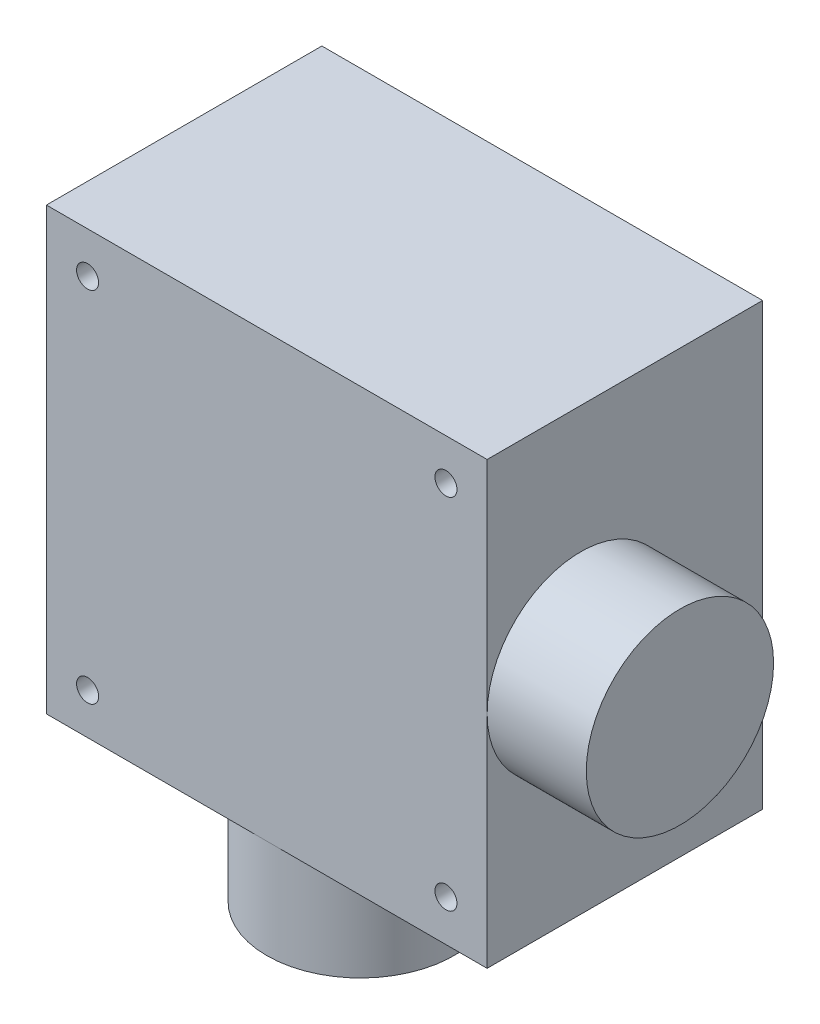
ISO-10303-21;
HEADER;
FILE_DESCRIPTION(('STEP AP214'),'2;1');
FILE_NAME('part.step','',(''),(''),'','','');
FILE_SCHEMA(('AUTOMOTIVE_DESIGN { 1 0 10303 214 1 1 1 1 }'));
ENDSEC;
DATA;
#1=APPLICATION_CONTEXT('core data for automotive mechanical design processes');
#2=APPLICATION_PROTOCOL_DEFINITION('international standard','automotive_design',2000,#1);
#3=PRODUCT_CONTEXT('',#1,'mechanical');
#4=PRODUCT('Part','Part','',(#3));
#5=PRODUCT_RELATED_PRODUCT_CATEGORY('part','',(#4));
#6=PRODUCT_DEFINITION_FORMATION('','',#4);
#7=PRODUCT_DEFINITION_CONTEXT('part definition',#1,'design');
#8=PRODUCT_DEFINITION('design','',#6,#7);
#9=PRODUCT_DEFINITION_SHAPE('','',#8);
#10=(LENGTH_UNIT() NAMED_UNIT(*) SI_UNIT(.MILLI.,.METRE.));
#11=(NAMED_UNIT(*) PLANE_ANGLE_UNIT() SI_UNIT($,.RADIAN.));
#12=(NAMED_UNIT(*) SI_UNIT($,.STERADIAN.) SOLID_ANGLE_UNIT());
#13=UNCERTAINTY_MEASURE_WITH_UNIT(LENGTH_MEASURE(1.E-05),#10,'distance_accuracy_value','');
#14=(GEOMETRIC_REPRESENTATION_CONTEXT(3) GLOBAL_UNCERTAINTY_ASSIGNED_CONTEXT((#13)) GLOBAL_UNIT_ASSIGNED_CONTEXT((#10,
#11,#12)) REPRESENTATION_CONTEXT('',''));
#15=CARTESIAN_POINT('',(0.,0.,0.));
#16=DIRECTION('',(0.,0.,1.));
#17=DIRECTION('',(1.,0.,0.));
#18=AXIS2_PLACEMENT_3D('',#15,#16,#17);
#19=CARTESIAN_POINT('',(-20.,20.,25.));
#20=DIRECTION('',(1.,0.,0.));
#21=DIRECTION('',(0.,1.,0.));
#22=AXIS2_PLACEMENT_3D('',#19,#20,#21);
#23=PLANE('',#22);
#24=DIRECTION('',(0.,-1.,0.));
#25=VECTOR('',#24,1.);
#26=CARTESIAN_POINT('',(-20.,20.,0.));
#27=LINE('',#26,#25);
#28=CARTESIAN_POINT('',(-20.,20.,0.));
#29=VERTEX_POINT('',#28);
#30=CARTESIAN_POINT('',(-20.,-20.,0.));
#31=VERTEX_POINT('',#30);
#32=EDGE_CURVE('E107',#29,#31,#27,.T.);
#33=ORIENTED_EDGE('',*,*,#32,.T.);
#34=DIRECTION('',(0.,0.,-1.));
#35=VECTOR('',#34,1.);
#36=CARTESIAN_POINT('',(-20.,-20.,25.));
#37=LINE('',#36,#35);
#38=CARTESIAN_POINT('',(-20.,-20.,25.));
#39=VERTEX_POINT('',#38);
#40=EDGE_CURVE('E11',#39,#31,#37,.T.);
#41=ORIENTED_EDGE('',*,*,#40,.F.);
#42=DIRECTION('',(0.,-1.,0.));
#43=VECTOR('',#42,1.);
#44=CARTESIAN_POINT('',(-20.,20.,25.));
#45=LINE('',#44,#43);
#46=CARTESIAN_POINT('',(-20.,20.,25.));
#47=VERTEX_POINT('',#46);
#48=EDGE_CURVE('E91',#47,#39,#45,.T.);
#49=ORIENTED_EDGE('',*,*,#48,.F.);
#50=DIRECTION('',(0.,0.,-1.));
#51=VECTOR('',#50,1.);
#52=CARTESIAN_POINT('',(-20.,20.,25.));
#53=LINE('',#52,#51);
#54=EDGE_CURVE('E106',#47,#29,#53,.T.);
#55=ORIENTED_EDGE('',*,*,#54,.T.);
#56=EDGE_LOOP('',(#33,#41,#49,#55));
#57=FACE_BOUND('',#56,.T.);
#58=ADVANCED_FACE('F34',(#57),#23,.F.);
#59=CARTESIAN_POINT('',(-20.,-20.,25.));
#60=DIRECTION('',(0.,1.,0.));
#61=DIRECTION('',(0.,0.,1.));
#62=AXIS2_PLACEMENT_3D('',#59,#60,#61);
#63=PLANE('',#62);
#64=DIRECTION('',(1.,0.,0.));
#65=VECTOR('',#64,1.);
#66=CARTESIAN_POINT('',(-20.,-20.,25.));
#67=LINE('',#66,#65);
#68=CARTESIAN_POINT('',(0.,-20.,25.));
#69=VERTEX_POINT('',#68);
#70=CARTESIAN_POINT('',(20.,-20.,25.));
#71=VERTEX_POINT('',#70);
#72=EDGE_CURVE('E88',#69,#71,#67,.T.);
#73=ORIENTED_EDGE('',*,*,#72,.F.);
#74=CARTESIAN_POINT('',(0.,-20.,16.5));
#75=DIRECTION('',(0.,-1.,0.));
#76=DIRECTION('',(0.,0.,-1.));
#77=AXIS2_PLACEMENT_3D('',#74,#75,#76);
#78=CIRCLE('',#77,8.5);
#79=EDGE_CURVE('E97',#69,#69,#78,.T.);
#80=ORIENTED_EDGE('',*,*,#79,.F.);
#81=EDGE_CURVE('E82',#39,#69,#67,.T.);
#82=ORIENTED_EDGE('',*,*,#81,.F.);
#83=ORIENTED_EDGE('',*,*,#40,.T.);
#84=DIRECTION('',(1.,0.,0.));
#85=VECTOR('',#84,1.);
#86=CARTESIAN_POINT('',(-20.,-20.,0.));
#87=LINE('',#86,#85);
#88=CARTESIAN_POINT('',(20.,-20.,0.));
#89=VERTEX_POINT('',#88);
#90=EDGE_CURVE('E110',#31,#89,#87,.T.);
#91=ORIENTED_EDGE('',*,*,#90,.T.);
#92=DIRECTION('',(0.,0.,-1.));
#93=VECTOR('',#92,1.);
#94=CARTESIAN_POINT('',(20.,-20.,25.));
#95=LINE('',#94,#93);
#96=EDGE_CURVE('E41',#71,#89,#95,.T.);
#97=ORIENTED_EDGE('',*,*,#96,.F.);
#98=EDGE_LOOP('',(#73,#80,#82,#83,#91,#97));
#99=FACE_BOUND('',#98,.T.);
#100=ADVANCED_FACE('F95',(#99),#63,.F.);
#101=CARTESIAN_POINT('',(20.,20.,25.));
#102=DIRECTION('',(-1.,0.,0.));
#103=DIRECTION('',(0.,-1.,0.));
#104=AXIS2_PLACEMENT_3D('',#101,#102,#103);
#105=PLANE('',#104);
#106=DIRECTION('',(0.,1.,0.));
#107=VECTOR('',#106,1.);
#108=CARTESIAN_POINT('',(20.,20.,25.));
#109=LINE('',#108,#107);
#110=CARTESIAN_POINT('',(20.,0.,25.));
#111=VERTEX_POINT('',#110);
#112=CARTESIAN_POINT('',(20.,20.,25.));
#113=VERTEX_POINT('',#112);
#114=EDGE_CURVE('E93',#111,#113,#109,.T.);
#115=ORIENTED_EDGE('',*,*,#114,.F.);
#116=CARTESIAN_POINT('',(20.,0.,16.5));
#117=DIRECTION('',(-1.,0.,0.));
#118=DIRECTION('',(0.,0.,-1.));
#119=AXIS2_PLACEMENT_3D('',#116,#117,#118);
#120=CIRCLE('',#119,8.5);
#121=EDGE_CURVE('E46',#111,#111,#120,.T.);
#122=ORIENTED_EDGE('',*,*,#121,.T.);
#123=EDGE_CURVE('E103',#71,#111,#109,.T.);
#124=ORIENTED_EDGE('',*,*,#123,.F.);
#125=ORIENTED_EDGE('',*,*,#96,.T.);
#126=DIRECTION('',(0.,1.,0.));
#127=VECTOR('',#126,1.);
#128=CARTESIAN_POINT('',(20.,20.,0.));
#129=LINE('',#128,#127);
#130=CARTESIAN_POINT('',(20.,20.,0.));
#131=VERTEX_POINT('',#130);
#132=EDGE_CURVE('E113',#89,#131,#129,.T.);
#133=ORIENTED_EDGE('',*,*,#132,.T.);
#134=DIRECTION('',(0.,0.,-1.));
#135=VECTOR('',#134,1.);
#136=CARTESIAN_POINT('',(20.,20.,25.));
#137=LINE('',#136,#135);
#138=EDGE_CURVE('E117',#113,#131,#137,.T.);
#139=ORIENTED_EDGE('',*,*,#138,.F.);
#140=EDGE_LOOP('',(#115,#122,#124,#125,#133,#139));
#141=FACE_BOUND('',#140,.T.);
#142=ADVANCED_FACE('F121',(#141),#105,.F.);
#143=CARTESIAN_POINT('',(-20.,20.,25.));
#144=DIRECTION('',(0.,-1.,0.));
#145=DIRECTION('',(0.,0.,-1.));
#146=AXIS2_PLACEMENT_3D('',#143,#144,#145);
#147=PLANE('',#146);
#148=DIRECTION('',(-1.,0.,0.));
#149=VECTOR('',#148,1.);
#150=CARTESIAN_POINT('',(-20.,20.,0.));
#151=LINE('',#150,#149);
#152=EDGE_CURVE('E75',#131,#29,#151,.T.);
#153=ORIENTED_EDGE('',*,*,#152,.T.);
#154=ORIENTED_EDGE('',*,*,#54,.F.);
#155=DIRECTION('',(-1.,0.,0.));
#156=VECTOR('',#155,1.);
#157=CARTESIAN_POINT('',(-20.,20.,25.));
#158=LINE('',#157,#156);
#159=EDGE_CURVE('E54',#113,#47,#158,.T.);
#160=ORIENTED_EDGE('',*,*,#159,.F.);
#161=ORIENTED_EDGE('',*,*,#138,.T.);
#162=EDGE_LOOP('',(#153,#154,#160,#161));
#163=FACE_BOUND('',#162,.T.);
#164=ADVANCED_FACE('F127',(#163),#147,.F.);
#165=CARTESIAN_POINT('',(0.,0.,25.));
#166=DIRECTION('',(0.,0.,1.));
#167=DIRECTION('',(1.,0.,0.));
#168=AXIS2_PLACEMENT_3D('',#165,#166,#167);
#169=PLANE('',#168);
#170=CARTESIAN_POINT('',(16.2634559672906,16.2634559672906,25.));
#171=DIRECTION('',(0.,0.,1.));
#172=DIRECTION('',(1.,0.,0.));
#173=AXIS2_PLACEMENT_3D('',#170,#171,#172);
#174=CIRCLE('',#173,1.);
#175=CARTESIAN_POINT('',(17.2634559672906,16.2634559672906,25.));
#176=VERTEX_POINT('',#175);
#177=EDGE_CURVE('E172',#176,#176,#174,.T.);
#178=ORIENTED_EDGE('',*,*,#177,.F.);
#179=EDGE_LOOP('',(#178));
#180=FACE_BOUND('',#179,.T.);
#181=CARTESIAN_POINT('',(-16.2634559672906,-16.2634559672906,25.));
#182=DIRECTION('',(0.,0.,1.));
#183=DIRECTION('',(1.,0.,0.));
#184=AXIS2_PLACEMENT_3D('',#181,#182,#183);
#185=CIRCLE('',#184,1.);
#186=CARTESIAN_POINT('',(-15.2634559672906,-16.2634559672906,25.));
#187=VERTEX_POINT('',#186);
#188=EDGE_CURVE('E176',#187,#187,#185,.T.);
#189=ORIENTED_EDGE('',*,*,#188,.F.);
#190=EDGE_LOOP('',(#189));
#191=FACE_BOUND('',#190,.T.);
#192=CARTESIAN_POINT('',(16.2634559672906,-16.2634559672906,25.));
#193=DIRECTION('',(0.,0.,1.));
#194=DIRECTION('',(1.,0.,0.));
#195=AXIS2_PLACEMENT_3D('',#192,#193,#194);
#196=CIRCLE('',#195,1.);
#197=CARTESIAN_POINT('',(17.2634559672906,-16.2634559672906,25.));
#198=VERTEX_POINT('',#197);
#199=EDGE_CURVE('E180',#198,#198,#196,.T.);
#200=ORIENTED_EDGE('',*,*,#199,.F.);
#201=EDGE_LOOP('',(#200));
#202=FACE_BOUND('',#201,.T.);
#203=CARTESIAN_POINT('',(-16.2634559672906,16.2634559672906,25.));
#204=DIRECTION('',(0.,0.,1.));
#205=DIRECTION('',(1.,0.,0.));
#206=AXIS2_PLACEMENT_3D('',#203,#204,#205);
#207=CIRCLE('',#206,1.);
#208=CARTESIAN_POINT('',(-15.2634559672906,16.2634559672906,25.));
#209=VERTEX_POINT('',#208);
#210=EDGE_CURVE('E134',#209,#209,#207,.T.);
#211=ORIENTED_EDGE('',*,*,#210,.F.);
#212=EDGE_LOOP('',(#211));
#213=FACE_BOUND('',#212,.T.);
#214=ORIENTED_EDGE('',*,*,#48,.T.);
#215=ORIENTED_EDGE('',*,*,#81,.T.);
#216=ORIENTED_EDGE('',*,*,#72,.T.);
#217=ORIENTED_EDGE('',*,*,#123,.T.);
#218=ORIENTED_EDGE('',*,*,#114,.T.);
#219=ORIENTED_EDGE('',*,*,#159,.T.);
#220=EDGE_LOOP('',(#214,#215,#216,#217,#218,#219));
#221=FACE_BOUND('',#220,.T.);
#222=ADVANCED_FACE('F86',(#180,#191,#202,#213,#221),#169,.T.);
#223=CARTESIAN_POINT('',(0.,0.,0.));
#224=DIRECTION('',(0.,0.,1.));
#225=DIRECTION('',(1.,0.,0.));
#226=AXIS2_PLACEMENT_3D('',#223,#224,#225);
#227=PLANE('',#226);
#228=ORIENTED_EDGE('',*,*,#32,.F.);
#229=ORIENTED_EDGE('',*,*,#152,.F.);
#230=ORIENTED_EDGE('',*,*,#132,.F.);
#231=ORIENTED_EDGE('',*,*,#90,.F.);
#232=EDGE_LOOP('',(#228,#229,#230,#231));
#233=FACE_BOUND('',#232,.T.);
#234=ADVANCED_FACE('F125',(#233),#227,.F.);
#235=CARTESIAN_POINT('',(0.,-29.,16.5));
#236=DIRECTION('',(0.,1.,0.));
#237=DIRECTION('',(0.,0.,1.));
#238=AXIS2_PLACEMENT_3D('',#235,#236,#237);
#239=CYLINDRICAL_SURFACE('',#238,8.5);
#240=CARTESIAN_POINT('',(0.,-29.,16.5));
#241=DIRECTION('',(0.,-1.,0.));
#242=DIRECTION('',(0.,0.,-1.));
#243=AXIS2_PLACEMENT_3D('',#240,#241,#242);
#244=CIRCLE('',#243,8.5);
#245=CARTESIAN_POINT('',(0.,-29.,8.));
#246=VERTEX_POINT('',#245);
#247=EDGE_CURVE('E111',#246,#246,#244,.T.);
#248=ORIENTED_EDGE('',*,*,#247,.F.);
#249=EDGE_LOOP('',(#248));
#250=FACE_BOUND('',#249,.T.);
#251=ORIENTED_EDGE('',*,*,#79,.T.);
#252=EDGE_LOOP('',(#251));
#253=FACE_BOUND('',#252,.T.);
#254=ADVANCED_FACE('F140',(#250,#253),#239,.T.);
#255=CARTESIAN_POINT('',(0.,-29.,16.5));
#256=DIRECTION('',(0.,-1.,0.));
#257=DIRECTION('',(0.,0.,-1.));
#258=AXIS2_PLACEMENT_3D('',#255,#256,#257);
#259=PLANE('',#258);
#260=ORIENTED_EDGE('',*,*,#247,.T.);
#261=EDGE_LOOP('',(#260));
#262=FACE_BOUND('',#261,.T.);
#263=ADVANCED_FACE('F142',(#262),#259,.T.);
#264=CARTESIAN_POINT('',(29.,0.,16.5));
#265=DIRECTION('',(-1.,0.,0.));
#266=DIRECTION('',(0.,-1.,0.));
#267=AXIS2_PLACEMENT_3D('',#264,#265,#266);
#268=CYLINDRICAL_SURFACE('',#267,8.5);
#269=CARTESIAN_POINT('',(29.,0.,16.5));
#270=DIRECTION('',(-1.,0.,0.));
#271=DIRECTION('',(0.,0.,-1.));
#272=AXIS2_PLACEMENT_3D('',#269,#270,#271);
#273=CIRCLE('',#272,8.5);
#274=CARTESIAN_POINT('',(29.,0.,8.));
#275=VERTEX_POINT('',#274);
#276=EDGE_CURVE('E128',#275,#275,#273,.T.);
#277=ORIENTED_EDGE('',*,*,#276,.T.);
#278=EDGE_LOOP('',(#277));
#279=FACE_BOUND('',#278,.T.);
#280=ORIENTED_EDGE('',*,*,#121,.F.);
#281=EDGE_LOOP('',(#280));
#282=FACE_BOUND('',#281,.T.);
#283=ADVANCED_FACE('F149',(#279,#282),#268,.T.);
#284=CARTESIAN_POINT('',(29.,0.,16.5));
#285=DIRECTION('',(1.,0.,0.));
#286=DIRECTION('',(0.,0.,-1.));
#287=AXIS2_PLACEMENT_3D('',#284,#285,#286);
#288=PLANE('',#287);
#289=ORIENTED_EDGE('',*,*,#276,.F.);
#290=EDGE_LOOP('',(#289));
#291=FACE_BOUND('',#290,.T.);
#292=ADVANCED_FACE('F232',(#291),#288,.T.);
#293=CARTESIAN_POINT('',(-16.2634559672906,16.2634559672906,15.));
#294=DIRECTION('',(0.,0.,1.));
#295=DIRECTION('',(1.,0.,0.));
#296=AXIS2_PLACEMENT_3D('',#293,#294,#295);
#297=CYLINDRICAL_SURFACE('',#296,1.);
#298=CARTESIAN_POINT('',(-16.2634559672906,16.2634559672906,15.));
#299=DIRECTION('',(0.,0.,1.));
#300=DIRECTION('',(1.,0.,0.));
#301=AXIS2_PLACEMENT_3D('',#298,#299,#300);
#302=CIRCLE('',#301,1.);
#303=CARTESIAN_POINT('',(-15.2634559672906,16.2634559672906,15.));
#304=VERTEX_POINT('',#303);
#305=EDGE_CURVE('E129',#304,#304,#302,.T.);
#306=ORIENTED_EDGE('',*,*,#305,.F.);
#307=EDGE_LOOP('',(#306));
#308=FACE_BOUND('',#307,.T.);
#309=ORIENTED_EDGE('',*,*,#210,.T.);
#310=EDGE_LOOP('',(#309));
#311=FACE_BOUND('',#310,.T.);
#312=ADVANCED_FACE('F228',(#308,#311),#297,.F.);
#313=CARTESIAN_POINT('',(-16.2634559672906,16.2634559672906,15.));
#314=DIRECTION('',(0.,0.,1.));
#315=DIRECTION('',(1.,0.,0.));
#316=AXIS2_PLACEMENT_3D('',#313,#314,#315);
#317=PLANE('',#316);
#318=ORIENTED_EDGE('',*,*,#305,.T.);
#319=EDGE_LOOP('',(#318));
#320=FACE_BOUND('',#319,.T.);
#321=ADVANCED_FACE('F224',(#320),#317,.T.);
#322=CARTESIAN_POINT('',(16.2634559672906,-16.2634559672906,15.));
#323=DIRECTION('',(0.,0.,1.));
#324=DIRECTION('',(1.,0.,0.));
#325=AXIS2_PLACEMENT_3D('',#322,#323,#324);
#326=CYLINDRICAL_SURFACE('',#325,1.);
#327=CARTESIAN_POINT('',(16.2634559672906,-16.2634559672906,15.));
#328=DIRECTION('',(0.,0.,1.));
#329=DIRECTION('',(1.,0.,0.));
#330=AXIS2_PLACEMENT_3D('',#327,#328,#329);
#331=CIRCLE('',#330,1.);
#332=CARTESIAN_POINT('',(17.2634559672906,-16.2634559672906,15.));
#333=VERTEX_POINT('',#332);
#334=EDGE_CURVE('E189',#333,#333,#331,.T.);
#335=ORIENTED_EDGE('',*,*,#334,.F.);
#336=EDGE_LOOP('',(#335));
#337=FACE_BOUND('',#336,.T.);
#338=ORIENTED_EDGE('',*,*,#199,.T.);
#339=EDGE_LOOP('',(#338));
#340=FACE_BOUND('',#339,.T.);
#341=ADVANCED_FACE('F220',(#337,#340),#326,.F.);
#342=CARTESIAN_POINT('',(16.2634559672906,-16.2634559672906,15.));
#343=DIRECTION('',(0.,0.,1.));
#344=DIRECTION('',(1.,0.,0.));
#345=AXIS2_PLACEMENT_3D('',#342,#343,#344);
#346=PLANE('',#345);
#347=ORIENTED_EDGE('',*,*,#334,.T.);
#348=EDGE_LOOP('',(#347));
#349=FACE_BOUND('',#348,.T.);
#350=ADVANCED_FACE('F216',(#349),#346,.T.);
#351=CARTESIAN_POINT('',(-16.2634559672906,-16.2634559672906,15.));
#352=DIRECTION('',(0.,0.,1.));
#353=DIRECTION('',(1.,0.,0.));
#354=AXIS2_PLACEMENT_3D('',#351,#352,#353);
#355=CYLINDRICAL_SURFACE('',#354,1.);
#356=CARTESIAN_POINT('',(-16.2634559672906,-16.2634559672906,15.));
#357=DIRECTION('',(0.,0.,1.));
#358=DIRECTION('',(1.,0.,0.));
#359=AXIS2_PLACEMENT_3D('',#356,#357,#358);
#360=CIRCLE('',#359,1.);
#361=CARTESIAN_POINT('',(-15.2634559672906,-16.2634559672906,15.));
#362=VERTEX_POINT('',#361);
#363=EDGE_CURVE('E193',#362,#362,#360,.T.);
#364=ORIENTED_EDGE('',*,*,#363,.F.);
#365=EDGE_LOOP('',(#364));
#366=FACE_BOUND('',#365,.T.);
#367=ORIENTED_EDGE('',*,*,#188,.T.);
#368=EDGE_LOOP('',(#367));
#369=FACE_BOUND('',#368,.T.);
#370=ADVANCED_FACE('F209',(#366,#369),#355,.F.);
#371=CARTESIAN_POINT('',(-16.2634559672906,-16.2634559672906,15.));
#372=DIRECTION('',(0.,0.,1.));
#373=DIRECTION('',(1.,0.,0.));
#374=AXIS2_PLACEMENT_3D('',#371,#372,#373);
#375=PLANE('',#374);
#376=ORIENTED_EDGE('',*,*,#363,.T.);
#377=EDGE_LOOP('',(#376));
#378=FACE_BOUND('',#377,.T.);
#379=ADVANCED_FACE('F200',(#378),#375,.T.);
#380=CARTESIAN_POINT('',(16.2634559672906,16.2634559672906,15.));
#381=DIRECTION('',(0.,0.,1.));
#382=DIRECTION('',(1.,0.,0.));
#383=AXIS2_PLACEMENT_3D('',#380,#381,#382);
#384=CYLINDRICAL_SURFACE('',#383,1.);
#385=CARTESIAN_POINT('',(16.2634559672906,16.2634559672906,15.));
#386=DIRECTION('',(0.,0.,1.));
#387=DIRECTION('',(1.,0.,0.));
#388=AXIS2_PLACEMENT_3D('',#385,#386,#387);
#389=CIRCLE('',#388,1.);
#390=CARTESIAN_POINT('',(17.2634559672906,16.2634559672906,15.));
#391=VERTEX_POINT('',#390);
#392=EDGE_CURVE('E184',#391,#391,#389,.T.);
#393=ORIENTED_EDGE('',*,*,#392,.F.);
#394=EDGE_LOOP('',(#393));
#395=FACE_BOUND('',#394,.T.);
#396=ORIENTED_EDGE('',*,*,#177,.T.);
#397=EDGE_LOOP('',(#396));
#398=FACE_BOUND('',#397,.T.);
#399=ADVANCED_FACE('F197',(#395,#398),#384,.F.);
#400=CARTESIAN_POINT('',(16.2634559672906,16.2634559672906,15.));
#401=DIRECTION('',(0.,0.,1.));
#402=DIRECTION('',(1.,0.,0.));
#403=AXIS2_PLACEMENT_3D('',#400,#401,#402);
#404=PLANE('',#403);
#405=ORIENTED_EDGE('',*,*,#392,.T.);
#406=EDGE_LOOP('',(#405));
#407=FACE_BOUND('',#406,.T.);
#408=ADVANCED_FACE('F199',(#407),#404,.T.);
#409=CLOSED_SHELL('',(#58,#100,#142,#164,#222,#234,#254,#263,#283,#292,#312,#321,#341,#350,#370,
#379,#399,#408));
#410=MANIFOLD_SOLID_BREP('B2',#409);
#411=ADVANCED_BREP_SHAPE_REPRESENTATION('',(#18,#410),#14);
#412=SHAPE_DEFINITION_REPRESENTATION(#9,#411);
ENDSEC;
END-ISO-10303-21;
